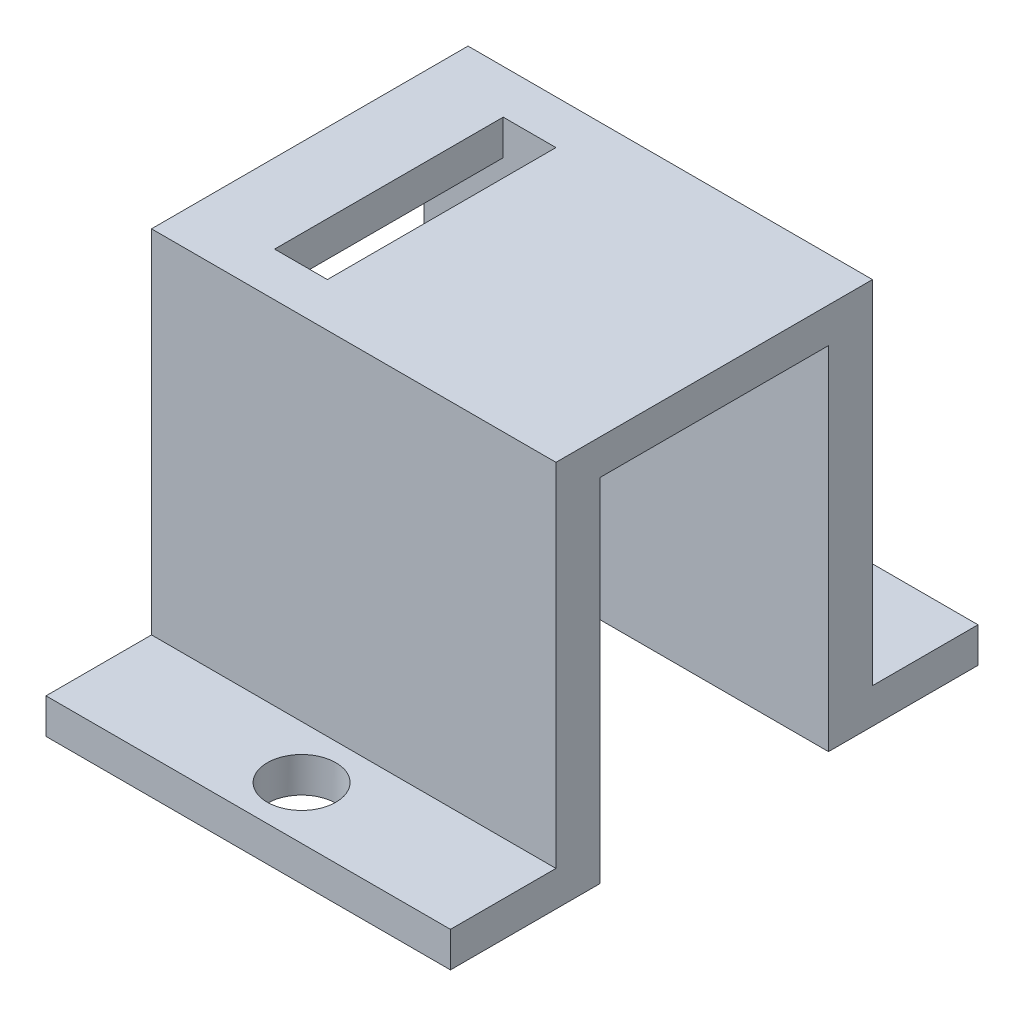
ISO-10303-21;
HEADER;
FILE_DESCRIPTION(('STEP AP214'),'2;1');
FILE_NAME('part.step','',(''),(''),'','','');
FILE_SCHEMA(('AUTOMOTIVE_DESIGN { 1 0 10303 214 1 1 1 1 }'));
ENDSEC;
DATA;
#1=APPLICATION_CONTEXT('core data for automotive mechanical design processes');
#2=APPLICATION_PROTOCOL_DEFINITION('international standard','automotive_design',2000,#1);
#3=PRODUCT_CONTEXT('',#1,'mechanical');
#4=PRODUCT('Part','Part','',(#3));
#5=PRODUCT_RELATED_PRODUCT_CATEGORY('part','',(#4));
#6=PRODUCT_DEFINITION_FORMATION('','',#4);
#7=PRODUCT_DEFINITION_CONTEXT('part definition',#1,'design');
#8=PRODUCT_DEFINITION('design','',#6,#7);
#9=PRODUCT_DEFINITION_SHAPE('','',#8);
#10=(LENGTH_UNIT() NAMED_UNIT(*) SI_UNIT(.MILLI.,.METRE.));
#11=(NAMED_UNIT(*) PLANE_ANGLE_UNIT() SI_UNIT($,.RADIAN.));
#12=(NAMED_UNIT(*) SI_UNIT($,.STERADIAN.) SOLID_ANGLE_UNIT());
#13=UNCERTAINTY_MEASURE_WITH_UNIT(LENGTH_MEASURE(1.E-05),#10,'distance_accuracy_value','');
#14=(GEOMETRIC_REPRESENTATION_CONTEXT(3) GLOBAL_UNCERTAINTY_ASSIGNED_CONTEXT((#13)) GLOBAL_UNIT_ASSIGNED_CONTEXT((#10,
#11,#12)) REPRESENTATION_CONTEXT('',''));
#15=CARTESIAN_POINT('',(0.,0.,0.));
#16=DIRECTION('',(0.,0.,1.));
#17=DIRECTION('',(1.,0.,0.));
#18=AXIS2_PLACEMENT_3D('',#15,#16,#17);
#19=CARTESIAN_POINT('',(0.,0.,0.));
#20=DIRECTION('',(0.,-1.,0.));
#21=DIRECTION('',(0.,0.,-1.));
#22=AXIS2_PLACEMENT_3D('',#19,#20,#21);
#23=PLANE('',#22);
#24=DIRECTION('',(-1.,0.,0.));
#25=VECTOR('',#24,1.);
#26=CARTESIAN_POINT('',(4.5,0.,-21.5));
#27=LINE('',#26,#25);
#28=CARTESIAN_POINT('',(23.,0.,-21.5));
#29=VERTEX_POINT('',#28);
#30=CARTESIAN_POINT('',(0.,0.,-21.5));
#31=VERTEX_POINT('',#30);
#32=EDGE_CURVE('E185',#29,#31,#27,.T.);
#33=ORIENTED_EDGE('',*,*,#32,.T.);
#34=DIRECTION('',(0.,0.,1.));
#35=VECTOR('',#34,1.);
#36=CARTESIAN_POINT('',(0.,0.,0.));
#37=LINE('',#36,#35);
#38=CARTESIAN_POINT('',(0.,0.,-30.));
#39=VERTEX_POINT('',#38);
#40=EDGE_CURVE('E256',#39,#31,#37,.T.);
#41=ORIENTED_EDGE('',*,*,#40,.F.);
#42=DIRECTION('',(-1.,0.,0.));
#43=VECTOR('',#42,1.);
#44=CARTESIAN_POINT('',(0.,0.,-30.));
#45=LINE('',#44,#43);
#46=CARTESIAN_POINT('',(23.,0.,-30.));
#47=VERTEX_POINT('',#46);
#48=EDGE_CURVE('E253',#47,#39,#45,.T.);
#49=ORIENTED_EDGE('',*,*,#48,.F.);
#50=DIRECTION('',(0.,0.,-1.));
#51=VECTOR('',#50,1.);
#52=CARTESIAN_POINT('',(23.,0.,0.));
#53=LINE('',#52,#51);
#54=EDGE_CURVE('E261',#29,#47,#53,.T.);
#55=ORIENTED_EDGE('',*,*,#54,.F.);
#56=EDGE_LOOP('',(#33,#41,#49,#55));
#57=FACE_BOUND('',#56,.T.);
#58=CARTESIAN_POINT('',(11.5344703984319,0.,-27.));
#59=DIRECTION('',(0.,-1.,0.));
#60=DIRECTION('',(0.,0.,-1.));
#61=AXIS2_PLACEMENT_3D('',#58,#59,#60);
#62=CIRCLE('',#61,1.94999999999999);
#63=CARTESIAN_POINT('',(11.5344703984319,0.,-28.95));
#64=VERTEX_POINT('',#63);
#65=EDGE_CURVE('E36',#64,#64,#62,.T.);
#66=ORIENTED_EDGE('',*,*,#65,.F.);
#67=EDGE_LOOP('',(#66));
#68=FACE_BOUND('',#67,.T.);
#69=ADVANCED_FACE('F32',(#57,#68),#23,.T.);
#70=CARTESIAN_POINT('',(4.5,0.,-21.5));
#71=DIRECTION('',(-1.,0.,0.));
#72=DIRECTION('',(0.,0.,1.));
#73=AXIS2_PLACEMENT_3D('',#70,#71,#72);
#74=PLANE('',#73);
#75=DIRECTION('',(0.,0.,1.));
#76=VECTOR('',#75,1.);
#77=CARTESIAN_POINT('',(4.5,20.,-21.5));
#78=LINE('',#77,#76);
#79=CARTESIAN_POINT('',(4.5,20.,-21.5));
#80=VERTEX_POINT('',#79);
#81=CARTESIAN_POINT('',(4.5,20.,-8.5));
#82=VERTEX_POINT('',#81);
#83=EDGE_CURVE('E150',#80,#82,#78,.T.);
#84=ORIENTED_EDGE('',*,*,#83,.F.);
#85=DIRECTION('',(0.,1.,0.));
#86=VECTOR('',#85,1.);
#87=CARTESIAN_POINT('',(4.5,0.,-21.5));
#88=LINE('',#87,#86);
#89=CARTESIAN_POINT('',(4.5,22.,-21.5));
#90=VERTEX_POINT('',#89);
#91=EDGE_CURVE('E199',#80,#90,#88,.T.);
#92=ORIENTED_EDGE('',*,*,#91,.T.);
#93=DIRECTION('',(0.,0.,1.));
#94=VECTOR('',#93,1.);
#95=CARTESIAN_POINT('',(4.5,22.,-21.5));
#96=LINE('',#95,#94);
#97=CARTESIAN_POINT('',(4.5,22.,-8.5));
#98=VERTEX_POINT('',#97);
#99=EDGE_CURVE('E183',#90,#98,#96,.T.);
#100=ORIENTED_EDGE('',*,*,#99,.T.);
#101=DIRECTION('',(0.,1.,0.));
#102=VECTOR('',#101,1.);
#103=CARTESIAN_POINT('',(4.5,0.,-8.5));
#104=LINE('',#103,#102);
#105=EDGE_CURVE('E188',#82,#98,#104,.T.);
#106=ORIENTED_EDGE('',*,*,#105,.F.);
#107=EDGE_LOOP('',(#84,#92,#100,#106));
#108=FACE_BOUND('',#107,.T.);
#109=ADVANCED_FACE('F295',(#108),#74,.F.);
#110=CARTESIAN_POINT('',(7.5,0.,-21.5));
#111=DIRECTION('',(1.,0.,0.));
#112=DIRECTION('',(0.,0.,-1.));
#113=AXIS2_PLACEMENT_3D('',#110,#111,#112);
#114=PLANE('',#113);
#115=DIRECTION('',(0.,0.,-1.));
#116=VECTOR('',#115,1.);
#117=CARTESIAN_POINT('',(7.5,20.,-21.5));
#118=LINE('',#117,#116);
#119=CARTESIAN_POINT('',(7.5,20.,-8.5));
#120=VERTEX_POINT('',#119);
#121=CARTESIAN_POINT('',(7.5,20.,-21.5));
#122=VERTEX_POINT('',#121);
#123=EDGE_CURVE('E171',#120,#122,#118,.T.);
#124=ORIENTED_EDGE('',*,*,#123,.F.);
#125=DIRECTION('',(0.,1.,0.));
#126=VECTOR('',#125,1.);
#127=CARTESIAN_POINT('',(7.5,0.,-8.5));
#128=LINE('',#127,#126);
#129=CARTESIAN_POINT('',(7.5,22.,-8.5));
#130=VERTEX_POINT('',#129);
#131=EDGE_CURVE('E204',#120,#130,#128,.T.);
#132=ORIENTED_EDGE('',*,*,#131,.T.);
#133=DIRECTION('',(0.,0.,-1.));
#134=VECTOR('',#133,1.);
#135=CARTESIAN_POINT('',(7.5,22.,-21.5));
#136=LINE('',#135,#134);
#137=CARTESIAN_POINT('',(7.5,22.,-21.5));
#138=VERTEX_POINT('',#137);
#139=EDGE_CURVE('E194',#130,#138,#136,.T.);
#140=ORIENTED_EDGE('',*,*,#139,.T.);
#141=DIRECTION('',(0.,1.,0.));
#142=VECTOR('',#141,1.);
#143=CARTESIAN_POINT('',(7.5,0.,-21.5));
#144=LINE('',#143,#142);
#145=EDGE_CURVE('E202',#122,#138,#144,.T.);
#146=ORIENTED_EDGE('',*,*,#145,.F.);
#147=EDGE_LOOP('',(#124,#132,#140,#146));
#148=FACE_BOUND('',#147,.T.);
#149=ADVANCED_FACE('F300',(#148),#114,.F.);
#150=CARTESIAN_POINT('',(0.,22.,0.));
#151=DIRECTION('',(0.,0.,-1.));
#152=DIRECTION('',(-1.,0.,0.));
#153=AXIS2_PLACEMENT_3D('',#150,#151,#152);
#154=PLANE('',#153);
#155=DIRECTION('',(1.,0.,0.));
#156=VECTOR('',#155,1.);
#157=CARTESIAN_POINT('',(0.,2.,0.));
#158=LINE('',#157,#156);
#159=CARTESIAN_POINT('',(0.,2.,0.));
#160=VERTEX_POINT('',#159);
#161=CARTESIAN_POINT('',(23.,2.,0.));
#162=VERTEX_POINT('',#161);
#163=EDGE_CURVE('E213',#160,#162,#158,.T.);
#164=ORIENTED_EDGE('',*,*,#163,.F.);
#165=DIRECTION('',(0.,-1.,0.));
#166=VECTOR('',#165,1.);
#167=CARTESIAN_POINT('',(0.,22.,0.));
#168=LINE('',#167,#166);
#169=CARTESIAN_POINT('',(0.,0.,0.));
#170=VERTEX_POINT('',#169);
#171=EDGE_CURVE('E11',#160,#170,#168,.T.);
#172=ORIENTED_EDGE('',*,*,#171,.T.);
#173=DIRECTION('',(1.,0.,0.));
#174=VECTOR('',#173,1.);
#175=CARTESIAN_POINT('',(0.,0.,0.));
#176=LINE('',#175,#174);
#177=CARTESIAN_POINT('',(23.,0.,0.));
#178=VERTEX_POINT('',#177);
#179=EDGE_CURVE('E258',#170,#178,#176,.T.);
#180=ORIENTED_EDGE('',*,*,#179,.T.);
#181=DIRECTION('',(0.,-1.,0.));
#182=VECTOR('',#181,1.);
#183=CARTESIAN_POINT('',(23.,22.,0.));
#184=LINE('',#183,#182);
#185=EDGE_CURVE('E41',#162,#178,#184,.T.);
#186=ORIENTED_EDGE('',*,*,#185,.F.);
#187=EDGE_LOOP('',(#164,#172,#180,#186));
#188=FACE_BOUND('',#187,.T.);
#189=ADVANCED_FACE('F356',(#188),#154,.F.);
#190=CARTESIAN_POINT('',(0.,22.,-30.));
#191=DIRECTION('',(0.,0.,1.));
#192=DIRECTION('',(1.,0.,0.));
#193=AXIS2_PLACEMENT_3D('',#190,#191,#192);
#194=PLANE('',#193);
#195=DIRECTION('',(-1.,0.,0.));
#196=VECTOR('',#195,1.);
#197=CARTESIAN_POINT('',(0.,2.,-30.));
#198=LINE('',#197,#196);
#199=CARTESIAN_POINT('',(23.,2.,-30.));
#200=VERTEX_POINT('',#199);
#201=CARTESIAN_POINT('',(0.,2.,-30.));
#202=VERTEX_POINT('',#201);
#203=EDGE_CURVE('E239',#200,#202,#198,.T.);
#204=ORIENTED_EDGE('',*,*,#203,.F.);
#205=DIRECTION('',(0.,-1.,0.));
#206=VECTOR('',#205,1.);
#207=CARTESIAN_POINT('',(23.,22.,-30.));
#208=LINE('',#207,#206);
#209=EDGE_CURVE('E268',#200,#47,#208,.T.);
#210=ORIENTED_EDGE('',*,*,#209,.T.);
#211=ORIENTED_EDGE('',*,*,#48,.T.);
#212=DIRECTION('',(0.,-1.,0.));
#213=VECTOR('',#212,1.);
#214=CARTESIAN_POINT('',(0.,22.,-30.));
#215=LINE('',#214,#213);
#216=EDGE_CURVE('E255',#202,#39,#215,.T.);
#217=ORIENTED_EDGE('',*,*,#216,.F.);
#218=EDGE_LOOP('',(#204,#210,#211,#217));
#219=FACE_BOUND('',#218,.T.);
#220=ADVANCED_FACE('F336',(#219),#194,.F.);
#221=CARTESIAN_POINT('',(0.,22.,0.));
#222=DIRECTION('',(1.,0.,0.));
#223=DIRECTION('',(0.,0.,-1.));
#224=AXIS2_PLACEMENT_3D('',#221,#222,#223);
#225=PLANE('',#224);
#226=ORIENTED_EDGE('',*,*,#40,.T.);
#227=DIRECTION('',(0.,-1.,0.));
#228=VECTOR('',#227,1.);
#229=CARTESIAN_POINT('',(0.,20.,-21.5));
#230=LINE('',#229,#228);
#231=CARTESIAN_POINT('',(0.,20.,-21.5));
#232=VERTEX_POINT('',#231);
#233=EDGE_CURVE('E161',#232,#31,#230,.T.);
#234=ORIENTED_EDGE('',*,*,#233,.F.);
#235=DIRECTION('',(0.,0.,-1.));
#236=VECTOR('',#235,1.);
#237=CARTESIAN_POINT('',(0.,20.,-21.5));
#238=LINE('',#237,#236);
#239=CARTESIAN_POINT('',(0.,20.,-8.5));
#240=VERTEX_POINT('',#239);
#241=EDGE_CURVE('E149',#240,#232,#238,.T.);
#242=ORIENTED_EDGE('',*,*,#241,.F.);
#243=DIRECTION('',(0.,-1.,0.));
#244=VECTOR('',#243,1.);
#245=CARTESIAN_POINT('',(0.,20.,-8.5));
#246=LINE('',#245,#244);
#247=CARTESIAN_POINT('',(0.,0.,-8.5));
#248=VERTEX_POINT('',#247);
#249=EDGE_CURVE('E155',#240,#248,#246,.T.);
#250=ORIENTED_EDGE('',*,*,#249,.T.);
#251=EDGE_CURVE('E247',#248,#170,#37,.T.);
#252=ORIENTED_EDGE('',*,*,#251,.T.);
#253=ORIENTED_EDGE('',*,*,#171,.F.);
#254=DIRECTION('',(0.,0.,1.));
#255=VECTOR('',#254,1.);
#256=CARTESIAN_POINT('',(0.,2.,0.));
#257=LINE('',#256,#255);
#258=CARTESIAN_POINT('',(0.,2.,-5.99999999999999));
#259=VERTEX_POINT('',#258);
#260=EDGE_CURVE('E222',#259,#160,#257,.T.);
#261=ORIENTED_EDGE('',*,*,#260,.F.);
#262=DIRECTION('',(0.,1.,0.));
#263=VECTOR('',#262,1.);
#264=CARTESIAN_POINT('',(0.,2.,-5.99999999999999));
#265=LINE('',#264,#263);
#266=CARTESIAN_POINT('',(0.,22.,-5.99999999999999));
#267=VERTEX_POINT('',#266);
#268=EDGE_CURVE('E226',#259,#267,#265,.T.);
#269=ORIENTED_EDGE('',*,*,#268,.T.);
#270=DIRECTION('',(0.,0.,1.));
#271=VECTOR('',#270,1.);
#272=CARTESIAN_POINT('',(0.,22.,0.));
#273=LINE('',#272,#271);
#274=CARTESIAN_POINT('',(0.,22.,-24.));
#275=VERTEX_POINT('',#274);
#276=EDGE_CURVE('E249',#275,#267,#273,.T.);
#277=ORIENTED_EDGE('',*,*,#276,.F.);
#278=DIRECTION('',(0.,1.,0.));
#279=VECTOR('',#278,1.);
#280=CARTESIAN_POINT('',(0.,2.,-24.));
#281=LINE('',#280,#279);
#282=CARTESIAN_POINT('',(0.,2.,-24.));
#283=VERTEX_POINT('',#282);
#284=EDGE_CURVE('E241',#283,#275,#281,.T.);
#285=ORIENTED_EDGE('',*,*,#284,.F.);
#286=DIRECTION('',(0.,0.,1.));
#287=VECTOR('',#286,1.);
#288=CARTESIAN_POINT('',(0.,2.,-30.));
#289=LINE('',#288,#287);
#290=EDGE_CURVE('E231',#202,#283,#289,.T.);
#291=ORIENTED_EDGE('',*,*,#290,.F.);
#292=ORIENTED_EDGE('',*,*,#216,.T.);
#293=EDGE_LOOP('',(#226,#234,#242,#250,#252,#253,#261,#269,#277,#285,#291,#292));
#294=FACE_BOUND('',#293,.T.);
#295=ADVANCED_FACE('F34',(#294),#225,.F.);
#296=CARTESIAN_POINT('',(23.,22.,0.));
#297=DIRECTION('',(-1.,0.,0.));
#298=DIRECTION('',(0.,0.,1.));
#299=AXIS2_PLACEMENT_3D('',#296,#297,#298);
#300=PLANE('',#299);
#301=DIRECTION('',(0.,0.,1.));
#302=VECTOR('',#301,1.);
#303=CARTESIAN_POINT('',(23.,20.,0.));
#304=LINE('',#303,#302);
#305=CARTESIAN_POINT('',(23.,20.,-21.5));
#306=VERTEX_POINT('',#305);
#307=CARTESIAN_POINT('',(23.,20.,-8.5));
#308=VERTEX_POINT('',#307);
#309=EDGE_CURVE('E175',#306,#308,#304,.T.);
#310=ORIENTED_EDGE('',*,*,#309,.F.);
#311=DIRECTION('',(0.,-1.,0.));
#312=VECTOR('',#311,1.);
#313=CARTESIAN_POINT('',(23.,22.,-21.5));
#314=LINE('',#313,#312);
#315=EDGE_CURVE('E180',#306,#29,#314,.T.);
#316=ORIENTED_EDGE('',*,*,#315,.T.);
#317=ORIENTED_EDGE('',*,*,#54,.T.);
#318=ORIENTED_EDGE('',*,*,#209,.F.);
#319=DIRECTION('',(0.,0.,-1.));
#320=VECTOR('',#319,1.);
#321=CARTESIAN_POINT('',(23.,2.,-30.));
#322=LINE('',#321,#320);
#323=CARTESIAN_POINT('',(23.,2.,-24.));
#324=VERTEX_POINT('',#323);
#325=EDGE_CURVE('E237',#324,#200,#322,.T.);
#326=ORIENTED_EDGE('',*,*,#325,.F.);
#327=DIRECTION('',(0.,1.,0.));
#328=VECTOR('',#327,1.);
#329=CARTESIAN_POINT('',(23.,2.,-24.));
#330=LINE('',#329,#328);
#331=CARTESIAN_POINT('',(23.,22.,-24.));
#332=VERTEX_POINT('',#331);
#333=EDGE_CURVE('E244',#324,#332,#330,.T.);
#334=ORIENTED_EDGE('',*,*,#333,.T.);
#335=DIRECTION('',(0.,0.,-1.));
#336=VECTOR('',#335,1.);
#337=CARTESIAN_POINT('',(23.,22.,0.));
#338=LINE('',#337,#336);
#339=CARTESIAN_POINT('',(23.,22.,-6.));
#340=VERTEX_POINT('',#339);
#341=EDGE_CURVE('E252',#340,#332,#338,.T.);
#342=ORIENTED_EDGE('',*,*,#341,.F.);
#343=DIRECTION('',(0.,1.,0.));
#344=VECTOR('',#343,1.);
#345=CARTESIAN_POINT('',(23.,2.,-6.));
#346=LINE('',#345,#344);
#347=CARTESIAN_POINT('',(23.,2.,-6.));
#348=VERTEX_POINT('',#347);
#349=EDGE_CURVE('E224',#348,#340,#346,.T.);
#350=ORIENTED_EDGE('',*,*,#349,.F.);
#351=DIRECTION('',(0.,0.,-1.));
#352=VECTOR('',#351,1.);
#353=CARTESIAN_POINT('',(23.,2.,0.));
#354=LINE('',#353,#352);
#355=EDGE_CURVE('E215',#162,#348,#354,.T.);
#356=ORIENTED_EDGE('',*,*,#355,.F.);
#357=ORIENTED_EDGE('',*,*,#185,.T.);
#358=CARTESIAN_POINT('',(23.,0.,-8.5));
#359=VERTEX_POINT('',#358);
#360=EDGE_CURVE('E262',#178,#359,#53,.T.);
#361=ORIENTED_EDGE('',*,*,#360,.T.);
#362=DIRECTION('',(0.,1.,0.));
#363=VECTOR('',#362,1.);
#364=CARTESIAN_POINT('',(23.,22.,-8.5));
#365=LINE('',#364,#363);
#366=EDGE_CURVE('E177',#359,#308,#365,.T.);
#367=ORIENTED_EDGE('',*,*,#366,.T.);
#368=EDGE_LOOP('',(#310,#316,#317,#318,#326,#334,#342,#350,#356,#357,#361,#367));
#369=FACE_BOUND('',#368,.T.);
#370=ADVANCED_FACE('F290',(#369),#300,.F.);
#371=CARTESIAN_POINT('',(0.,22.,0.));
#372=DIRECTION('',(0.,-1.,0.));
#373=DIRECTION('',(0.,0.,-1.));
#374=AXIS2_PLACEMENT_3D('',#371,#372,#373);
#375=PLANE('',#374);
#376=DIRECTION('',(1.,0.,0.));
#377=VECTOR('',#376,1.);
#378=CARTESIAN_POINT('',(4.5,22.,-8.5));
#379=LINE('',#378,#377);
#380=EDGE_CURVE('E191',#98,#130,#379,.T.);
#381=ORIENTED_EDGE('',*,*,#380,.F.);
#382=ORIENTED_EDGE('',*,*,#99,.F.);
#383=DIRECTION('',(-1.,0.,0.));
#384=VECTOR('',#383,1.);
#385=CARTESIAN_POINT('',(4.5,22.,-21.5));
#386=LINE('',#385,#384);
#387=EDGE_CURVE('E186',#138,#90,#386,.T.);
#388=ORIENTED_EDGE('',*,*,#387,.F.);
#389=ORIENTED_EDGE('',*,*,#139,.F.);
#390=EDGE_LOOP('',(#381,#382,#388,#389));
#391=FACE_BOUND('',#390,.T.);
#392=ORIENTED_EDGE('',*,*,#276,.T.);
#393=DIRECTION('',(-1.,0.,0.));
#394=VECTOR('',#393,1.);
#395=CARTESIAN_POINT('',(0.,22.,-5.99999999999999));
#396=LINE('',#395,#394);
#397=EDGE_CURVE('E216',#340,#267,#396,.T.);
#398=ORIENTED_EDGE('',*,*,#397,.F.);
#399=ORIENTED_EDGE('',*,*,#341,.T.);
#400=DIRECTION('',(1.,0.,0.));
#401=VECTOR('',#400,1.);
#402=CARTESIAN_POINT('',(0.,22.,-24.));
#403=LINE('',#402,#401);
#404=EDGE_CURVE('E229',#275,#332,#403,.T.);
#405=ORIENTED_EDGE('',*,*,#404,.F.);
#406=EDGE_LOOP('',(#392,#398,#399,#405));
#407=FACE_BOUND('',#406,.T.);
#408=ADVANCED_FACE('F280',(#391,#407),#375,.F.);
#409=DIRECTION('',(1.,0.,0.));
#410=VECTOR('',#409,1.);
#411=CARTESIAN_POINT('',(4.5,0.,-8.5));
#412=LINE('',#411,#410);
#413=EDGE_CURVE('E158',#248,#359,#412,.T.);
#414=ORIENTED_EDGE('',*,*,#413,.T.);
#415=ORIENTED_EDGE('',*,*,#360,.F.);
#416=ORIENTED_EDGE('',*,*,#179,.F.);
#417=ORIENTED_EDGE('',*,*,#251,.F.);
#418=EDGE_LOOP('',(#414,#415,#416,#417));
#419=FACE_BOUND('',#418,.T.);
#420=CARTESIAN_POINT('',(11.5344703984319,0.,-2.99999999999999));
#421=DIRECTION('',(0.,-1.,0.));
#422=DIRECTION('',(0.,0.,-1.));
#423=AXIS2_PLACEMENT_3D('',#420,#421,#422);
#424=CIRCLE('',#423,1.94999999999999);
#425=CARTESIAN_POINT('',(11.5344703984319,0.,-4.94999999999998));
#426=VERTEX_POINT('',#425);
#427=EDGE_CURVE('E212',#426,#426,#424,.T.);
#428=ORIENTED_EDGE('',*,*,#427,.F.);
#429=EDGE_LOOP('',(#428));
#430=FACE_BOUND('',#429,.T.);
#431=ADVANCED_FACE('F277',(#419,#430),#23,.T.);
#432=CARTESIAN_POINT('',(0.,2.,-24.));
#433=DIRECTION('',(0.,0.,1.));
#434=DIRECTION('',(1.,0.,0.));
#435=AXIS2_PLACEMENT_3D('',#432,#433,#434);
#436=PLANE('',#435);
#437=ORIENTED_EDGE('',*,*,#404,.T.);
#438=ORIENTED_EDGE('',*,*,#333,.F.);
#439=DIRECTION('',(1.,0.,0.));
#440=VECTOR('',#439,1.);
#441=CARTESIAN_POINT('',(0.,2.,-24.));
#442=LINE('',#441,#440);
#443=EDGE_CURVE('E234',#283,#324,#442,.T.);
#444=ORIENTED_EDGE('',*,*,#443,.F.);
#445=ORIENTED_EDGE('',*,*,#284,.T.);
#446=EDGE_LOOP('',(#437,#438,#444,#445));
#447=FACE_BOUND('',#446,.T.);
#448=ADVANCED_FACE('F279',(#447),#436,.F.);
#449=CARTESIAN_POINT('',(0.,2.,0.));
#450=DIRECTION('',(0.,1.,0.));
#451=DIRECTION('',(0.,0.,1.));
#452=AXIS2_PLACEMENT_3D('',#449,#450,#451);
#453=PLANE('',#452);
#454=CARTESIAN_POINT('',(11.5344703984319,2.,-27.));
#455=DIRECTION('',(0.,1.,0.));
#456=DIRECTION('',(0.,0.,1.));
#457=AXIS2_PLACEMENT_3D('',#454,#455,#456);
#458=CIRCLE('',#457,1.94999999999999);
#459=CARTESIAN_POINT('',(11.5344703984319,2.,-25.05));
#460=VERTEX_POINT('',#459);
#461=EDGE_CURVE('E201',#460,#460,#458,.T.);
#462=ORIENTED_EDGE('',*,*,#461,.F.);
#463=EDGE_LOOP('',(#462));
#464=FACE_BOUND('',#463,.T.);
#465=ORIENTED_EDGE('',*,*,#290,.T.);
#466=ORIENTED_EDGE('',*,*,#443,.T.);
#467=ORIENTED_EDGE('',*,*,#325,.T.);
#468=ORIENTED_EDGE('',*,*,#203,.T.);
#469=EDGE_LOOP('',(#465,#466,#467,#468));
#470=FACE_BOUND('',#469,.T.);
#471=ADVANCED_FACE('F287',(#464,#470),#453,.T.);
#472=CARTESIAN_POINT('',(0.,2.,-5.99999999999999));
#473=DIRECTION('',(0.,0.,-1.));
#474=DIRECTION('',(-1.,0.,0.));
#475=AXIS2_PLACEMENT_3D('',#472,#473,#474);
#476=PLANE('',#475);
#477=ORIENTED_EDGE('',*,*,#397,.T.);
#478=ORIENTED_EDGE('',*,*,#268,.F.);
#479=DIRECTION('',(-1.,0.,0.));
#480=VECTOR('',#479,1.);
#481=CARTESIAN_POINT('',(0.,2.,-5.99999999999999));
#482=LINE('',#481,#480);
#483=EDGE_CURVE('E219',#348,#259,#482,.T.);
#484=ORIENTED_EDGE('',*,*,#483,.F.);
#485=ORIENTED_EDGE('',*,*,#349,.T.);
#486=EDGE_LOOP('',(#477,#478,#484,#485));
#487=FACE_BOUND('',#486,.T.);
#488=ADVANCED_FACE('F318',(#487),#476,.F.);
#489=CARTESIAN_POINT('',(0.,2.,0.));
#490=DIRECTION('',(0.,1.,0.));
#491=DIRECTION('',(0.,0.,1.));
#492=AXIS2_PLACEMENT_3D('',#489,#490,#491);
#493=PLANE('',#492);
#494=CARTESIAN_POINT('',(11.5344703984319,2.,-2.99999999999999));
#495=DIRECTION('',(0.,1.,0.));
#496=DIRECTION('',(0.,0.,1.));
#497=AXIS2_PLACEMENT_3D('',#494,#495,#496);
#498=CIRCLE('',#497,1.94999999999999);
#499=CARTESIAN_POINT('',(11.5344703984319,2.,-1.05));
#500=VERTEX_POINT('',#499);
#501=EDGE_CURVE('E209',#500,#500,#498,.T.);
#502=ORIENTED_EDGE('',*,*,#501,.F.);
#503=EDGE_LOOP('',(#502));
#504=FACE_BOUND('',#503,.T.);
#505=ORIENTED_EDGE('',*,*,#163,.T.);
#506=ORIENTED_EDGE('',*,*,#355,.T.);
#507=ORIENTED_EDGE('',*,*,#483,.T.);
#508=ORIENTED_EDGE('',*,*,#260,.T.);
#509=EDGE_LOOP('',(#505,#506,#507,#508));
#510=FACE_BOUND('',#509,.T.);
#511=ADVANCED_FACE('F358',(#504,#510),#493,.T.);
#512=CARTESIAN_POINT('',(11.5344703984319,2.,-2.99999999999999));
#513=DIRECTION('',(0.,1.,0.));
#514=DIRECTION('',(0.,0.,1.));
#515=AXIS2_PLACEMENT_3D('',#512,#513,#514);
#516=CYLINDRICAL_SURFACE('',#515,1.94999999999999);
#517=ORIENTED_EDGE('',*,*,#427,.T.);
#518=EDGE_LOOP('',(#517));
#519=FACE_BOUND('',#518,.T.);
#520=ORIENTED_EDGE('',*,*,#501,.T.);
#521=EDGE_LOOP('',(#520));
#522=FACE_BOUND('',#521,.T.);
#523=ADVANCED_FACE('F274',(#519,#522),#516,.F.);
#524=CARTESIAN_POINT('',(11.5344703984319,2.,-27.));
#525=DIRECTION('',(0.,1.,0.));
#526=DIRECTION('',(0.,0.,1.));
#527=AXIS2_PLACEMENT_3D('',#524,#525,#526);
#528=CYLINDRICAL_SURFACE('',#527,1.94999999999999);
#529=ORIENTED_EDGE('',*,*,#65,.T.);
#530=EDGE_LOOP('',(#529));
#531=FACE_BOUND('',#530,.T.);
#532=ORIENTED_EDGE('',*,*,#461,.T.);
#533=EDGE_LOOP('',(#532));
#534=FACE_BOUND('',#533,.T.);
#535=ADVANCED_FACE('F309',(#531,#534),#528,.F.);
#536=CARTESIAN_POINT('',(4.5,0.,-21.5));
#537=DIRECTION('',(0.,0.,-1.));
#538=DIRECTION('',(-1.,0.,0.));
#539=AXIS2_PLACEMENT_3D('',#536,#537,#538);
#540=PLANE('',#539);
#541=ORIENTED_EDGE('',*,*,#32,.F.);
#542=ORIENTED_EDGE('',*,*,#315,.F.);
#543=DIRECTION('',(1.,0.,0.));
#544=VECTOR('',#543,1.);
#545=CARTESIAN_POINT('',(24.5,20.,-21.5));
#546=LINE('',#545,#544);
#547=EDGE_CURVE('E166',#122,#306,#546,.T.);
#548=ORIENTED_EDGE('',*,*,#547,.F.);
#549=ORIENTED_EDGE('',*,*,#145,.T.);
#550=ORIENTED_EDGE('',*,*,#387,.T.);
#551=ORIENTED_EDGE('',*,*,#91,.F.);
#552=EDGE_CURVE('E49',#232,#80,#546,.T.);
#553=ORIENTED_EDGE('',*,*,#552,.F.);
#554=ORIENTED_EDGE('',*,*,#233,.T.);
#555=EDGE_LOOP('',(#541,#542,#548,#549,#550,#551,#553,#554));
#556=FACE_BOUND('',#555,.T.);
#557=ADVANCED_FACE('F312',(#556),#540,.F.);
#558=CARTESIAN_POINT('',(4.5,0.,-8.5));
#559=DIRECTION('',(0.,0.,1.));
#560=DIRECTION('',(1.,0.,0.));
#561=AXIS2_PLACEMENT_3D('',#558,#559,#560);
#562=PLANE('',#561);
#563=ORIENTED_EDGE('',*,*,#413,.F.);
#564=ORIENTED_EDGE('',*,*,#249,.F.);
#565=DIRECTION('',(-1.,0.,0.));
#566=VECTOR('',#565,1.);
#567=CARTESIAN_POINT('',(24.5,20.,-8.5));
#568=LINE('',#567,#566);
#569=EDGE_CURVE('E145',#82,#240,#568,.T.);
#570=ORIENTED_EDGE('',*,*,#569,.F.);
#571=ORIENTED_EDGE('',*,*,#105,.T.);
#572=ORIENTED_EDGE('',*,*,#380,.T.);
#573=ORIENTED_EDGE('',*,*,#131,.F.);
#574=EDGE_CURVE('E57',#308,#120,#568,.T.);
#575=ORIENTED_EDGE('',*,*,#574,.F.);
#576=ORIENTED_EDGE('',*,*,#366,.F.);
#577=EDGE_LOOP('',(#563,#564,#570,#571,#572,#573,#575,#576));
#578=FACE_BOUND('',#577,.T.);
#579=ADVANCED_FACE('F156',(#578),#562,.F.);
#580=CARTESIAN_POINT('',(0.,20.,0.));
#581=DIRECTION('',(0.,-1.,0.));
#582=DIRECTION('',(0.,0.,-1.));
#583=AXIS2_PLACEMENT_3D('',#580,#581,#582);
#584=PLANE('',#583);
#585=ORIENTED_EDGE('',*,*,#309,.T.);
#586=ORIENTED_EDGE('',*,*,#574,.T.);
#587=ORIENTED_EDGE('',*,*,#123,.T.);
#588=ORIENTED_EDGE('',*,*,#547,.T.);
#589=EDGE_LOOP('',(#585,#586,#587,#588));
#590=FACE_BOUND('',#589,.T.);
#591=ADVANCED_FACE('F341',(#590),#584,.T.);
#592=ORIENTED_EDGE('',*,*,#83,.T.);
#593=ORIENTED_EDGE('',*,*,#569,.T.);
#594=ORIENTED_EDGE('',*,*,#241,.T.);
#595=ORIENTED_EDGE('',*,*,#552,.T.);
#596=EDGE_LOOP('',(#592,#593,#594,#595));
#597=FACE_BOUND('',#596,.T.);
#598=ADVANCED_FACE('F147',(#597),#584,.T.);
#599=CLOSED_SHELL('',(#69,#109,#149,#189,#220,#295,#370,#408,#431,#448,#471,#488,#511,#523,#535,
#557,#579,#591,#598));
#600=MANIFOLD_SOLID_BREP('B2',#599);
#601=ADVANCED_BREP_SHAPE_REPRESENTATION('',(#18,#600),#14);
#602=SHAPE_DEFINITION_REPRESENTATION(#9,#601);
ENDSEC;
END-ISO-10303-21;
